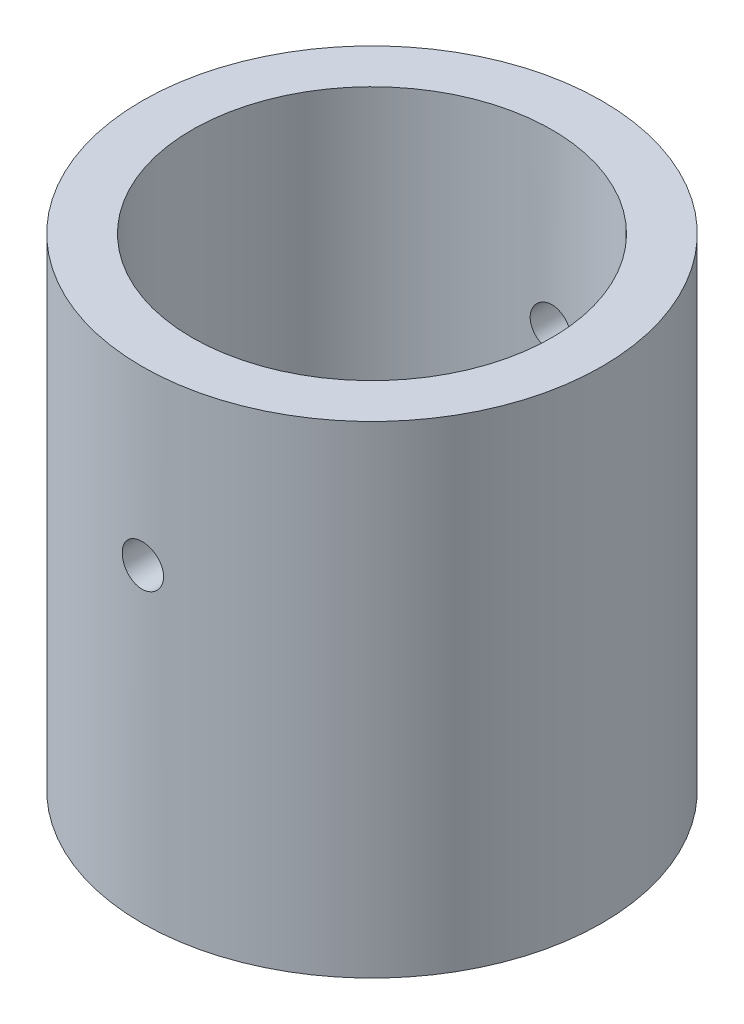
ISO-10303-21;
HEADER;
FILE_DESCRIPTION(('STEP AP214'),'2;1');
FILE_NAME('part.step','',(''),(''),'','','');
FILE_SCHEMA(('AUTOMOTIVE_DESIGN { 1 0 10303 214 1 1 1 1 }'));
ENDSEC;
DATA;
#1=APPLICATION_CONTEXT('core data for automotive mechanical design processes');
#2=APPLICATION_PROTOCOL_DEFINITION('international standard','automotive_design',2000,#1);
#3=PRODUCT_CONTEXT('',#1,'mechanical');
#4=PRODUCT('Part','Part','',(#3));
#5=PRODUCT_RELATED_PRODUCT_CATEGORY('part','',(#4));
#6=PRODUCT_DEFINITION_FORMATION('','',#4);
#7=PRODUCT_DEFINITION_CONTEXT('part definition',#1,'design');
#8=PRODUCT_DEFINITION('design','',#6,#7);
#9=PRODUCT_DEFINITION_SHAPE('','',#8);
#10=(LENGTH_UNIT() NAMED_UNIT(*) SI_UNIT(.MILLI.,.METRE.));
#11=(NAMED_UNIT(*) PLANE_ANGLE_UNIT() SI_UNIT($,.RADIAN.));
#12=(NAMED_UNIT(*) SI_UNIT($,.STERADIAN.) SOLID_ANGLE_UNIT());
#13=UNCERTAINTY_MEASURE_WITH_UNIT(LENGTH_MEASURE(1.E-05),#10,'distance_accuracy_value','');
#14=(GEOMETRIC_REPRESENTATION_CONTEXT(3) GLOBAL_UNCERTAINTY_ASSIGNED_CONTEXT((#13)) GLOBAL_UNIT_ASSIGNED_CONTEXT((#10,
#11,#12)) REPRESENTATION_CONTEXT('',''));
#15=CARTESIAN_POINT('',(0.,0.,0.));
#16=DIRECTION('',(0.,0.,1.));
#17=DIRECTION('',(1.,0.,0.));
#18=AXIS2_PLACEMENT_3D('',#15,#16,#17);
#19=CARTESIAN_POINT('',(0.,-10.,0.));
#20=DIRECTION('',(0.,1.,0.));
#21=DIRECTION('',(0.,0.,1.));
#22=AXIS2_PLACEMENT_3D('',#19,#20,#21);
#23=CYLINDRICAL_SURFACE('',#22,16.7005);
#24=CARTESIAN_POINT('',(0.,14.,-16.7005));
#25=CARTESIAN_POINT('',(0.0840739073478822,13.9999963389162,-16.7004991224491));
#26=CARTESIAN_POINT('',(0.168204443302505,13.9929077938446,-16.6998583708692));
#27=CARTESIAN_POINT('',(0.334136064030357,13.9647355315386,-16.6973638947488));
#28=CARTESIAN_POINT('',(0.415934428993811,13.9436361192293,-16.6955088099366));
#29=CARTESIAN_POINT('',(0.574774611508852,13.8880587094413,-16.6907952172819));
#30=CARTESIAN_POINT('',(0.651819157286573,13.853588469858,-16.6879372913899));
#31=CARTESIAN_POINT('',(0.799011016182334,13.7722622127763,-16.6815381735413));
#32=CARTESIAN_POINT('',(0.869159762218119,13.7254087759492,-16.6779971239898));
#33=CARTESIAN_POINT('',(1.00079248873406,13.6204980050071,-16.6706172347535));
#34=CARTESIAN_POINT('',(1.06225341632177,13.5624117964417,-16.6667776431958));
#35=CARTESIAN_POINT('',(1.17456792134735,13.4367456019084,-16.6592396902912));
#36=CARTESIAN_POINT('',(1.22542102394026,13.369165191172,-16.6555413352727));
#37=CARTESIAN_POINT('',(1.31515586886251,13.2262874315252,-16.6486966845945));
#38=CARTESIAN_POINT('',(1.35401710508066,13.1509771542979,-16.6455513384882));
#39=CARTESIAN_POINT('',(1.41853412471455,12.9948673718815,-16.6401777460108));
#40=CARTESIAN_POINT('',(1.4441901754162,12.9140679778349,-16.6379494810774));
#41=CARTESIAN_POINT('',(1.48150106735208,12.7495062868371,-16.6346688669631));
#42=CARTESIAN_POINT('',(1.49319375199995,12.665752634481,-16.6336133399801));
#43=CARTESIAN_POINT('',(1.50236293564543,12.4974654132801,-16.6327877449639));
#44=CARTESIAN_POINT('',(1.49983974065433,12.4129318612625,-16.6330176492604));
#45=CARTESIAN_POINT('',(1.48068003297399,12.245744336756,-16.6347340465401));
#46=CARTESIAN_POINT('',(1.46408471843637,12.1630856000218,-16.6362168713737));
#47=CARTESIAN_POINT('',(1.41731589335676,12.0017314772819,-16.6402662890315));
#48=CARTESIAN_POINT('',(1.38714223144538,11.9230361354704,-16.6428328939377));
#49=CARTESIAN_POINT('',(1.3140273437971,11.7717118042245,-16.6487649035404));
#50=CARTESIAN_POINT('',(1.27106770992614,11.6990917559108,-16.652131458517));
#51=CARTESIAN_POINT('',(1.17361359847447,11.5620772286155,-16.6592830161986));
#52=CARTESIAN_POINT('',(1.11911884900944,11.4976829435737,-16.6630680287658));
#53=CARTESIAN_POINT('',(0.999910698845735,11.3787083676798,-16.6706463571184));
#54=CARTESIAN_POINT('',(0.93516169524744,11.3241637420956,-16.6744396546541));
#55=CARTESIAN_POINT('',(0.797407017723522,11.2267128116824,-16.6815943820547));
#56=CARTESIAN_POINT('',(0.72440133703474,11.1838065163867,-16.6849558115658));
#57=CARTESIAN_POINT('',(0.572181924093607,11.110852128623,-16.6908688650665));
#58=CARTESIAN_POINT('',(0.492967389955397,11.0808057002807,-16.6934203842388));
#59=CARTESIAN_POINT('',(0.33058989114569,11.0344493534954,-16.6974249840035));
#60=CARTESIAN_POINT('',(0.247427021734967,11.0181391038196,-16.6988780910827));
#61=CARTESIAN_POINT('',(0.0798225786995192,10.9997630131269,-16.7005187417049));
#62=CARTESIAN_POINT('',(-0.00461355466242807,10.9976479266711,-16.7007106604767));
#63=CARTESIAN_POINT('',(-0.17263916704392,11.007593072566,-16.699819013058));
#64=CARTESIAN_POINT('',(-0.256228655248612,11.0196531509657,-16.6987354607201));
#65=CARTESIAN_POINT('',(-0.42004713057965,11.0575654545316,-16.6954175015306));
#66=CARTESIAN_POINT('',(-0.500281462032379,11.0833947683984,-16.6931850066731));
#67=CARTESIAN_POINT('',(-0.655277824431181,11.1480888896812,-16.6878198274718));
#68=CARTESIAN_POINT('',(-0.730039755381432,11.1869539352235,-16.6846871266837));
#69=CARTESIAN_POINT('',(-0.872192674320689,11.2767394402738,-16.6778615217508));
#70=CARTESIAN_POINT('',(-0.939563045677524,11.3276924251232,-16.6741671160137));
#71=CARTESIAN_POINT('',(-1.06481212264239,11.4401605849513,-16.6666379310917));
#72=CARTESIAN_POINT('',(-1.12269063651724,11.5016759732366,-16.6628031490732));
#73=CARTESIAN_POINT('',(-1.22748272152723,11.6337368754473,-16.6554123832421));
#74=CARTESIAN_POINT('',(-1.27436408880999,11.7043079970349,-16.6518572380307));
#75=CARTESIAN_POINT('',(-1.35561007066878,11.8523500751879,-16.6454405041055));
#76=CARTESIAN_POINT('',(-1.38997482741231,11.9298209533713,-16.6425789075142));
#77=CARTESIAN_POINT('',(-1.44515758812037,12.0893507223554,-16.6378781983044));
#78=CARTESIAN_POINT('',(-1.46599510231504,12.1714028192381,-16.6360376136491));
#79=CARTESIAN_POINT('',(-1.49359532085713,12.3378584243099,-16.633582545586));
#80=CARTESIAN_POINT('',(-1.5003583442629,12.4222618791515,-16.6329680343839));
#81=CARTESIAN_POINT('',(-1.49961365022275,12.590704248327,-16.6330351676116));
#82=CARTESIAN_POINT('',(-1.49215652690292,12.6747433927842,-16.6337122167778));
#83=CARTESIAN_POINT('',(-1.46328893309136,12.8403703160216,-16.6362764087617));
#84=CARTESIAN_POINT('',(-1.44187844319134,12.9219580913918,-16.6381635532625));
#85=CARTESIAN_POINT('',(-1.38572513293063,13.0803682109211,-16.642934070122));
#86=CARTESIAN_POINT('',(-1.35098344213868,13.1571909581863,-16.645817358074));
#87=CARTESIAN_POINT('',(-1.26915938382259,13.303922169385,-16.6522554477643));
#88=CARTESIAN_POINT('',(-1.22207716396824,13.3738307160418,-16.6558102414669));
#89=CARTESIAN_POINT('',(-1.11671831492446,13.5050082316671,-16.6632059007733));
#90=CARTESIAN_POINT('',(-1.05840410454961,13.5662469638901,-16.6670476994806));
#91=CARTESIAN_POINT('',(-0.932307639342731,13.6780940869861,-16.6745759524764));
#92=CARTESIAN_POINT('',(-0.864523105698723,13.7286999119381,-16.6782623690971));
#93=CARTESIAN_POINT('',(-0.72125920724578,13.8179242258068,-16.6850722283804));
#94=CARTESIAN_POINT('',(-0.645763987079093,13.8565173261441,-16.6881944729198));
#95=CARTESIAN_POINT('',(-0.489387213644493,13.9204291584459,-16.6935105885476));
#96=CARTESIAN_POINT('',(-0.408511928020682,13.9457630420884,-16.6957055187484));
#97=CARTESIAN_POINT('',(-0.272638732752223,13.9760347333788,-16.6983606057811));
#98=CARTESIAN_POINT('',(-0.21851279009077,13.9850096412518,-16.6991591938122));
#99=CARTESIAN_POINT('',(-0.109599253243924,13.9969934585151,-16.7002291761435));
#100=CARTESIAN_POINT('',(-0.0548116611578381,14.0000023868295,-16.7005005721159));
#101=CARTESIAN_POINT('',(0.,14.,-16.7005));
#102=B_SPLINE_CURVE_WITH_KNOTS('',3,(#24,#25,#26,#27,#28,#29,#30,#31,#32,#33,#34,#35,#36,#37,
#38,#39,#40,#41,#42,#43,#44,#45,#46,#47,#48,#49,#50,#51,#52,#53,#54,#55,#56,#57,#58,#59,#60,#61,
#62,#63,#64,#65,#66,#67,#68,#69,#70,#71,#72,#73,#74,#75,#76,#77,#78,#79,#80,#81,#82,#83,#84,#85,
#86,#87,#88,#89,#90,#91,#92,#93,#94,#95,#96,#97,#98,#99,#100,#101),.UNSPECIFIED.,.T.,.F.,(4,2,2,
2,2,2,2,2,2,2,2,2,2,2,2,2,2,2,2,2,2,2,2,2,2,2,2,2,2,2,2,2,2,2,2,2,2,2,4),(0.,0.25202158895579,
0.504325971650677,0.756484183115543,1.00858988592701,1.26135246778805,1.51412636179746,
1.76733013447015,2.02052878184841,2.2730396433461,2.5255450693112,2.77731379156742,
3.02908532057347,3.28122109640866,3.53336281578168,3.78639998339604,4.03943735827815,
4.29250746746459,4.54557147397378,4.79775710248519,5.04993999212971,5.30170456623724,
5.55347373962887,5.80592819611591,6.05838775149278,6.31157762459116,6.56476462179142,
6.81758563336241,7.07040091360438,7.32231837560675,7.57423618801164,7.82613265982793,
8.07802611752714,8.33077750628205,8.58358981883721,8.83693287151226,9.08998578639345,
9.25429081504527,9.41859532252041),.UNSPECIFIED.);
#103=CARTESIAN_POINT('',(0.,14.,-16.7005));
#104=VERTEX_POINT('',#103);
#105=EDGE_CURVE('E82',#104,#104,#102,.T.);
#106=ORIENTED_EDGE('',*,*,#105,.F.);
#107=EDGE_LOOP('',(#106));
#108=FACE_BOUND('',#107,.T.);
#109=CARTESIAN_POINT('',(0.,11.,16.7005));
#110=CARTESIAN_POINT('',(0.0840739073478822,11.0000036610838,16.7004991224491));
#111=CARTESIAN_POINT('',(0.168204443302505,11.0070922061554,16.6998583708692));
#112=CARTESIAN_POINT('',(0.334136064030357,11.0352644684614,16.6973638947488));
#113=CARTESIAN_POINT('',(0.415934428993811,11.0563638807707,16.6955088099366));
#114=CARTESIAN_POINT('',(0.574774611508852,11.1119412905587,16.6907952172819));
#115=CARTESIAN_POINT('',(0.651819157286573,11.146411530142,16.6879372913899));
#116=CARTESIAN_POINT('',(0.799011016182334,11.2277377872237,16.6815381735413));
#117=CARTESIAN_POINT('',(0.869159762218119,11.2745912240508,16.6779971239898));
#118=CARTESIAN_POINT('',(1.00079248873406,11.3795019949929,16.6706172347535));
#119=CARTESIAN_POINT('',(1.06225341632177,11.4375882035583,16.6667776431958));
#120=CARTESIAN_POINT('',(1.17456792134735,11.5632543980916,16.6592396902912));
#121=CARTESIAN_POINT('',(1.22542102394026,11.630834808828,16.6555413352727));
#122=CARTESIAN_POINT('',(1.31515586886251,11.7737125684748,16.6486966845945));
#123=CARTESIAN_POINT('',(1.35401710508066,11.8490228457021,16.6455513384882));
#124=CARTESIAN_POINT('',(1.41853412471455,12.0051326281185,16.6401777460108));
#125=CARTESIAN_POINT('',(1.4441901754162,12.0859320221651,16.6379494810774));
#126=CARTESIAN_POINT('',(1.48150106735208,12.2504937131629,16.6346688669631));
#127=CARTESIAN_POINT('',(1.49319375199995,12.334247365519,16.6336133399801));
#128=CARTESIAN_POINT('',(1.50236293564543,12.5025345867199,16.6327877449639));
#129=CARTESIAN_POINT('',(1.49983974065433,12.5870681387374,16.6330176492604));
#130=CARTESIAN_POINT('',(1.48068003297399,12.754255663244,16.6347340465401));
#131=CARTESIAN_POINT('',(1.46408471843637,12.8369143999782,16.6362168713737));
#132=CARTESIAN_POINT('',(1.41731589335676,12.998268522718,16.6402662890315));
#133=CARTESIAN_POINT('',(1.38714223144538,13.0769638645296,16.6428328939377));
#134=CARTESIAN_POINT('',(1.3140273437971,13.2282881957755,16.6487649035404));
#135=CARTESIAN_POINT('',(1.27106770992614,13.3009082440892,16.652131458517));
#136=CARTESIAN_POINT('',(1.17361359847447,13.4379227713845,16.6592830161986));
#137=CARTESIAN_POINT('',(1.11911884900944,13.5023170564263,16.6630680287658));
#138=CARTESIAN_POINT('',(0.999910698845735,13.6212916323202,16.6706463571184));
#139=CARTESIAN_POINT('',(0.93516169524744,13.6758362579044,16.6744396546541));
#140=CARTESIAN_POINT('',(0.797407017723522,13.7732871883176,16.6815943820547));
#141=CARTESIAN_POINT('',(0.72440133703474,13.8161934836133,16.6849558115658));
#142=CARTESIAN_POINT('',(0.572181924093607,13.889147871377,16.6908688650665));
#143=CARTESIAN_POINT('',(0.492967389955397,13.9191942997193,16.6934203842388));
#144=CARTESIAN_POINT('',(0.33058989114569,13.9655506465046,16.6974249840035));
#145=CARTESIAN_POINT('',(0.247427021734967,13.9818608961803,16.6988780910827));
#146=CARTESIAN_POINT('',(0.0798225786995192,14.0002369868731,16.7005187417049));
#147=CARTESIAN_POINT('',(-0.00461355466242807,14.0023520733289,16.7007106604767));
#148=CARTESIAN_POINT('',(-0.17263916704392,13.992406927434,16.699819013058));
#149=CARTESIAN_POINT('',(-0.256228655248612,13.9803468490343,16.6987354607201));
#150=CARTESIAN_POINT('',(-0.42004713057965,13.9424345454684,16.6954175015306));
#151=CARTESIAN_POINT('',(-0.500281462032378,13.9166052316016,16.6931850066731));
#152=CARTESIAN_POINT('',(-0.655277824431181,13.8519111103188,16.6878198274718));
#153=CARTESIAN_POINT('',(-0.730039755381432,13.8130460647765,16.6846871266837));
#154=CARTESIAN_POINT('',(-0.872192674320689,13.7232605597262,16.6778615217508));
#155=CARTESIAN_POINT('',(-0.939563045677524,13.6723075748768,16.6741671160137));
#156=CARTESIAN_POINT('',(-1.06481212264239,13.5598394150487,16.6666379310917));
#157=CARTESIAN_POINT('',(-1.12269063651724,13.4983240267634,16.6628031490732));
#158=CARTESIAN_POINT('',(-1.22748272152723,13.3662631245527,16.6554123832421));
#159=CARTESIAN_POINT('',(-1.27436408880999,13.2956920029651,16.6518572380307));
#160=CARTESIAN_POINT('',(-1.35561007066878,13.1476499248121,16.6454405041055));
#161=CARTESIAN_POINT('',(-1.38997482741231,13.0701790466287,16.6425789075142));
#162=CARTESIAN_POINT('',(-1.44515758812037,12.9106492776446,16.6378781983044));
#163=CARTESIAN_POINT('',(-1.46599510231504,12.8285971807619,16.6360376136491));
#164=CARTESIAN_POINT('',(-1.49359532085713,12.6621415756901,16.633582545586));
#165=CARTESIAN_POINT('',(-1.5003583442629,12.5777381208485,16.6329680343839));
#166=CARTESIAN_POINT('',(-1.49961365022275,12.409295751673,16.6330351676116));
#167=CARTESIAN_POINT('',(-1.49215652690292,12.3252566072158,16.6337122167778));
#168=CARTESIAN_POINT('',(-1.46328893309136,12.1596296839784,16.6362764087617));
#169=CARTESIAN_POINT('',(-1.44187844319134,12.0780419086082,16.6381635532625));
#170=CARTESIAN_POINT('',(-1.38572513293063,11.9196317890789,16.642934070122));
#171=CARTESIAN_POINT('',(-1.35098344213868,11.8428090418137,16.645817358074));
#172=CARTESIAN_POINT('',(-1.26915938382259,11.696077830615,16.6522554477643));
#173=CARTESIAN_POINT('',(-1.22207716396824,11.6261692839582,16.6558102414669));
#174=CARTESIAN_POINT('',(-1.11671831492446,11.4949917683329,16.6632059007733));
#175=CARTESIAN_POINT('',(-1.05840410454961,11.4337530361099,16.6670476994806));
#176=CARTESIAN_POINT('',(-0.932307639342731,11.3219059130139,16.6745759524764));
#177=CARTESIAN_POINT('',(-0.864523105698723,11.2713000880619,16.6782623690971));
#178=CARTESIAN_POINT('',(-0.72125920724578,11.1820757741932,16.6850722283804));
#179=CARTESIAN_POINT('',(-0.645763987079093,11.1434826738559,16.6881944729198));
#180=CARTESIAN_POINT('',(-0.489387213644493,11.0795708415541,16.6935105885476));
#181=CARTESIAN_POINT('',(-0.408511928020682,11.0542369579116,16.6957055187484));
#182=CARTESIAN_POINT('',(-0.272638732752223,11.0239652666212,16.6983606057811));
#183=CARTESIAN_POINT('',(-0.218512790090771,11.0149903587482,16.6991591938122));
#184=CARTESIAN_POINT('',(-0.109599253243924,11.0030065414849,16.7002291761435));
#185=CARTESIAN_POINT('',(-0.0548116611578381,10.9999976131705,16.7005005721159));
#186=CARTESIAN_POINT('',(0.,11.,16.7005));
#187=B_SPLINE_CURVE_WITH_KNOTS('',3,(#109,#110,#111,#112,#113,#114,#115,#116,#117,#118,#119,
#120,#121,#122,#123,#124,#125,#126,#127,#128,#129,#130,#131,#132,#133,#134,#135,#136,#137,#138,
#139,#140,#141,#142,#143,#144,#145,#146,#147,#148,#149,#150,#151,#152,#153,#154,#155,#156,#157,
#158,#159,#160,#161,#162,#163,#164,#165,#166,#167,#168,#169,#170,#171,#172,#173,#174,#175,#176,
#177,#178,#179,#180,#181,#182,#183,#184,#185,#186),.UNSPECIFIED.,.T.,.F.,(4,2,2,2,2,2,2,2,2,2,2,
2,2,2,2,2,2,2,2,2,2,2,2,2,2,2,2,2,2,2,2,2,2,2,2,2,2,2,4),(0.,0.25202158895579,0.504325971650677,
0.756484183115543,1.00858988592701,1.26135246778805,1.51412636179746,1.76733013447015,
2.02052878184841,2.2730396433461,2.5255450693112,2.77731379156742,3.02908532057347,
3.28122109640866,3.53336281578168,3.78639998339604,4.03943735827815,4.29250746746459,
4.54557147397378,4.79775710248519,5.04993999212971,5.30170456623724,5.55347373962887,
5.8059281961159,6.05838775149278,6.31157762459116,6.56476462179142,6.81758563336241,
7.07040091360438,7.32231837560675,7.57423618801164,7.82613265982793,8.07802611752714,
8.33077750628205,8.58358981883721,8.83693287151226,9.08998578639345,9.25429081504527,
9.41859532252041),.UNSPECIFIED.);
#188=CARTESIAN_POINT('',(0.,11.,16.7005));
#189=VERTEX_POINT('',#188);
#190=EDGE_CURVE('E88',#189,#189,#187,.T.);
#191=ORIENTED_EDGE('',*,*,#190,.F.);
#192=EDGE_LOOP('',(#191));
#193=FACE_BOUND('',#192,.T.);
#194=CARTESIAN_POINT('',(0.,-10.,0.));
#195=DIRECTION('',(0.,1.,0.));
#196=DIRECTION('',(0.,0.,1.));
#197=AXIS2_PLACEMENT_3D('',#194,#195,#196);
#198=CIRCLE('',#197,16.7005);
#199=CARTESIAN_POINT('',(0.,-10.,16.7005));
#200=VERTEX_POINT('',#199);
#201=EDGE_CURVE('E10',#200,#200,#198,.T.);
#202=ORIENTED_EDGE('',*,*,#201,.T.);
#203=EDGE_LOOP('',(#202));
#204=FACE_BOUND('',#203,.T.);
#205=CARTESIAN_POINT('',(0.,25.,0.));
#206=DIRECTION('',(0.,1.,0.));
#207=DIRECTION('',(0.,0.,1.));
#208=AXIS2_PLACEMENT_3D('',#205,#206,#207);
#209=CIRCLE('',#208,16.7005);
#210=CARTESIAN_POINT('',(0.,25.,16.7005));
#211=VERTEX_POINT('',#210);
#212=EDGE_CURVE('E59',#211,#211,#209,.T.);
#213=ORIENTED_EDGE('',*,*,#212,.F.);
#214=EDGE_LOOP('',(#213));
#215=FACE_BOUND('',#214,.T.);
#216=ADVANCED_FACE('F39',(#108,#193,#204,#215),#23,.T.);
#217=CARTESIAN_POINT('',(0.,-10.,0.));
#218=DIRECTION('',(0.,1.,0.));
#219=DIRECTION('',(0.,0.,1.));
#220=AXIS2_PLACEMENT_3D('',#217,#218,#219);
#221=PLANE('',#220);
#222=CARTESIAN_POINT('',(0.,-10.,0.));
#223=DIRECTION('',(0.,1.,0.));
#224=DIRECTION('',(0.,0.,1.));
#225=AXIS2_PLACEMENT_3D('',#222,#223,#224);
#226=CIRCLE('',#225,13.0683);
#227=CARTESIAN_POINT('',(0.,-10.,13.0683));
#228=VERTEX_POINT('',#227);
#229=EDGE_CURVE('E53',#228,#228,#226,.T.);
#230=ORIENTED_EDGE('',*,*,#229,.T.);
#231=EDGE_LOOP('',(#230));
#232=FACE_BOUND('',#231,.T.);
#233=ORIENTED_EDGE('',*,*,#201,.F.);
#234=EDGE_LOOP('',(#233));
#235=FACE_BOUND('',#234,.T.);
#236=ADVANCED_FACE('F105',(#232,#235),#221,.F.);
#237=CARTESIAN_POINT('',(0.,-10.,0.));
#238=DIRECTION('',(0.,1.,0.));
#239=DIRECTION('',(0.,0.,1.));
#240=AXIS2_PLACEMENT_3D('',#237,#238,#239);
#241=CYLINDRICAL_SURFACE('',#240,13.0683);
#242=CARTESIAN_POINT('',(0.,11.,13.0683));
#243=CARTESIAN_POINT('',(0.083959419714348,11.0000035986928,13.0682989093014));
#244=CARTESIAN_POINT('',(0.167972632303433,11.007072937343,13.0674823154631));
#245=CARTESIAN_POINT('',(0.333665011174969,11.0351644457216,13.0643032966192));
#246=CARTESIAN_POINT('',(0.415341584298046,11.0562015343523,13.0619392187899));
#247=CARTESIAN_POINT('',(0.573937670412875,11.1116038108933,13.0559317916325));
#248=CARTESIAN_POINT('',(0.650860206039492,11.145960426987,13.0522892651959));
#249=CARTESIAN_POINT('',(0.797831776722439,11.2270086369988,13.0441310084045));
#250=CARTESIAN_POINT('',(0.867882068984447,11.2736979689822,13.0396154382147));
#251=CARTESIAN_POINT('',(0.9994638663028,11.3783200726841,13.0301923642005));
#252=CARTESIAN_POINT('',(1.06095863543785,11.4362989110897,13.0252833047485));
#253=CARTESIAN_POINT('',(1.17336764914877,11.5617555217076,13.0156392138925));
#254=CARTESIAN_POINT('',(1.22428137688855,11.6292337576527,13.0109041909988));
#255=CARTESIAN_POINT('',(1.31421722863886,11.7720089488374,13.0021287819106));
#256=CARTESIAN_POINT('',(1.35320540530628,11.8473274212194,12.9980903927282));
#257=CARTESIAN_POINT('',(1.4179666531661,12.0034966034056,12.9911855685421));
#258=CARTESIAN_POINT('',(1.44374014890661,12.0843471353867,12.9883190958887));
#259=CARTESIAN_POINT('',(1.48122986195858,12.2489066044632,12.9840972331607));
#260=CARTESIAN_POINT('',(1.49300769207949,12.3326013322305,12.9827352219109));
#261=CARTESIAN_POINT('',(1.50236231243369,12.5007897361557,12.9816561268342));
#262=CARTESIAN_POINT('',(1.49993958736373,12.5852833849464,12.9819389868643));
#263=CARTESIAN_POINT('',(1.48101253301551,12.7522438209895,12.9841116185447));
#264=CARTESIAN_POINT('',(1.46457581120456,12.8347183869907,12.9859936750729));
#265=CARTESIAN_POINT('',(1.41819270046793,12.9957307132692,12.9911406025717));
#266=CARTESIAN_POINT('',(1.38824607727181,13.0742684052524,12.9944054975215));
#267=CARTESIAN_POINT('',(1.31561972100485,13.2253891590206,13.0019590421739));
#268=CARTESIAN_POINT('',(1.272910341207,13.2979578492859,13.0062500708046));
#269=CARTESIAN_POINT('',(1.1759920818651,13.4349232552091,13.0153704876364));
#270=CARTESIAN_POINT('',(1.1217827586042,13.4993196553918,13.0201998966072));
#271=CARTESIAN_POINT('',(1.00302746089424,13.6185051167426,13.0298872647189));
#272=CARTESIAN_POINT('',(0.938423162479797,13.6732360810241,13.0347452264357));
#273=CARTESIAN_POINT('',(0.800913349316004,13.7710856037659,13.0439159367024));
#274=CARTESIAN_POINT('',(0.728007820175392,13.814204142094,13.0482286843071));
#275=CARTESIAN_POINT('',(0.57592224284429,13.8876038435033,13.0558251378022));
#276=CARTESIAN_POINT('',(0.496740569888844,13.9178816694194,13.0591085761283));
#277=CARTESIAN_POINT('',(0.33437108477933,13.9646958954565,13.064273918848));
#278=CARTESIAN_POINT('',(0.251183430760447,13.9812328375259,13.0661558785163));
#279=CARTESIAN_POINT('',(0.0836660485400474,14.0000212696477,13.0682990732304));
#280=CARTESIAN_POINT('',(-0.000654585261720961,14.0023528506097,13.0685693946301));
#281=CARTESIAN_POINT('',(-0.168485383880464,13.9928752994393,13.0674833148144));
#282=CARTESIAN_POINT('',(-0.251995563170554,13.9810664202976,13.0661269427027));
#283=CARTESIAN_POINT('',(-0.415600827269171,13.9437096583779,13.0619455971228));
#284=CARTESIAN_POINT('',(-0.49570467588172,13.9181996650982,13.0591246744835));
#285=CARTESIAN_POINT('',(-0.650496831963124,13.8542040038225,13.0523303149499));
#286=CARTESIAN_POINT('',(-0.725184982139591,13.8157179591361,13.0483568445981));
#287=CARTESIAN_POINT('',(-0.867385244335154,13.7266667891655,13.0396783400163));
#288=CARTESIAN_POINT('',(-0.934864496182109,13.6760495014219,13.0349701780965));
#289=CARTESIAN_POINT('',(-1.06039788918208,13.5642469105692,13.0253595891529));
#290=CARTESIAN_POINT('',(-1.11845171654463,13.5030612557586,13.0204571556683));
#291=CARTESIAN_POINT('',(-1.22376785434973,13.3715073982892,13.0109828195366));
#292=CARTESIAN_POINT('',(-1.27097730012458,13.3010967353124,13.0064126073356));
#293=CARTESIAN_POINT('',(-1.35290014736306,13.1532990638355,12.9981471218405));
#294=CARTESIAN_POINT('',(-1.38761376551905,13.0759121763404,12.9944518333746));
#295=CARTESIAN_POINT('',(-1.44347270379213,12.9165340140986,12.9883657378988));
#296=CARTESIAN_POINT('',(-1.46464854488605,12.8345535530614,12.9859719983773));
#297=CARTESIAN_POINT('',(-1.49292945170328,12.6681714156221,12.98275134275));
#298=CARTESIAN_POINT('',(-1.50003506175628,12.5837698330131,12.9819243660316));
#299=CARTESIAN_POINT('',(-1.49996488082419,12.4154669874023,12.9819324335816));
#300=CARTESIAN_POINT('',(-1.49287213345557,12.3315656770913,12.9827578135174));
#301=CARTESIAN_POINT('',(-1.46478167472506,12.1661555646921,12.9859568932676));
#302=CARTESIAN_POINT('',(-1.44378395510147,12.0846467640255,12.988330594002));
#303=CARTESIAN_POINT('',(-1.38850427243594,11.9263419132945,12.9943560060979));
#304=CARTESIAN_POINT('',(-1.35422564254193,11.8495446863503,12.9980073967717));
#305=CARTESIAN_POINT('',(-1.27336545078431,11.7027795743084,13.0061773552408));
#306=CARTESIAN_POINT('',(-1.22678383101695,11.632811721355,13.0106959271174));
#307=CARTESIAN_POINT('',(-1.1223299454544,11.5012663380542,13.0201228080858));
#308=CARTESIAN_POINT('',(-1.06439573688705,11.4397381376282,13.0250331635438));
#309=CARTESIAN_POINT('',(-0.93900846000665,11.3272433618148,13.0346719610345));
#310=CARTESIAN_POINT('',(-0.87155313611058,11.2762792961879,13.0394003596223));
#311=CARTESIAN_POINT('',(-0.728792444723197,11.1862230955074,13.0481590051423));
#312=CARTESIAN_POINT('',(-0.653462415729782,11.147169854317,13.0521869467687));
#313=CARTESIAN_POINT('',(-0.497312067577631,11.0823215075292,13.0590669048896));
#314=CARTESIAN_POINT('',(-0.41649792465187,11.0565117586709,13.0619202194697));
#315=CARTESIAN_POINT('',(-0.279373312983838,11.0251738791891,13.0654288600473));
#316=CARTESIAN_POINT('',(-0.223933015819383,11.0157469474946,13.0665003907032));
#317=CARTESIAN_POINT('',(-0.112336504769582,11.0031588222733,13.0679363235181));
#318=CARTESIAN_POINT('',(-0.0561802950866237,10.999997591984,13.068300729826));
#319=CARTESIAN_POINT('',(0.,11.,13.0683));
#320=B_SPLINE_CURVE_WITH_KNOTS('',3,(#242,#243,#244,#245,#246,#247,#248,#249,#250,#251,#252,
#253,#254,#255,#256,#257,#258,#259,#260,#261,#262,#263,#264,#265,#266,#267,#268,#269,#270,#271,
#272,#273,#274,#275,#276,#277,#278,#279,#280,#281,#282,#283,#284,#285,#286,#287,#288,#289,#290,
#291,#292,#293,#294,#295,#296,#297,#298,#299,#300,#301,#302,#303,#304,#305,#306,#307,#308,#309,
#310,#311,#312,#313,#314,#315,#316,#317,#318,#319),.UNSPECIFIED.,.T.,.F.,(4,2,2,2,2,2,2,2,2,2,2,
2,2,2,2,2,2,2,2,2,2,2,2,2,2,2,2,2,2,2,2,2,2,2,2,2,2,2,4),(0.,0.251673076696307,
0.503615397841711,0.755395849277337,1.00713015386066,1.25991403787444,1.51271026633902,
1.76621954901159,2.01972068667977,2.27210165800259,2.52447401504791,2.77563570142195,
3.02680174326999,3.27855581733137,3.53031960690563,3.78354868392285,4.03677819995216,
4.29007348737733,4.54335878421227,4.79521470772957,5.0470661252907,5.29822462425576,
5.54939041489522,5.80165619229906,6.05393036639353,6.30740940560953,6.56088404898891,
6.81378519846032,7.06667656384983,7.31809313513363,7.56950985579768,7.82086351852121,
8.07221836425603,8.32498490431382,8.57781142640281,8.8314549060649,9.08481732581798,
9.25322190413147,9.42162549436901),.UNSPECIFIED.);
#321=CARTESIAN_POINT('',(0.,11.,13.0683));
#322=VERTEX_POINT('',#321);
#323=EDGE_CURVE('E43',#322,#322,#320,.T.);
#324=ORIENTED_EDGE('',*,*,#323,.T.);
#325=EDGE_LOOP('',(#324));
#326=FACE_BOUND('',#325,.T.);
#327=CARTESIAN_POINT('',(1.5,12.5,-12.9819283964286));
#328=CARTESIAN_POINT('',(1.49999639948689,12.4160426343039,-12.9819295142281));
#329=CARTESIAN_POINT('',(1.49292739504628,12.3320314695184,-12.9827516433486));
#330=CARTESIAN_POINT('',(1.46483733478457,12.1663433452089,-12.9859504308004));
#331=CARTESIAN_POINT('',(1.44380135288027,12.0846689804578,-12.9883287521473));
#332=CARTESIAN_POINT('',(1.38840231362,11.926077564794,-12.9943670655967));
#333=CARTESIAN_POINT('',(1.35404788062388,11.8491574725493,-12.9980262281421));
#334=CARTESIAN_POINT('',(1.2730048122647,11.7021899988986,-13.0062129207465));
#335=CARTESIAN_POINT('',(1.22631843350853,11.6321413633063,-13.0107402918915));
#336=CARTESIAN_POINT('',(1.1216993181703,11.5005577075767,-13.0201773288729));
#337=CARTESIAN_POINT('',(1.06371985463791,11.4390599451918,-13.0250885304977));
#338=CARTESIAN_POINT('',(0.938260735323255,11.3266451509393,-13.034725998433));
#339=CARTESIAN_POINT('',(0.870780623994517,11.2757286267215,-13.0394522558617));
#340=CARTESIAN_POINT('',(0.728003777451471,11.1857898409728,-13.0482028321936));
#341=CARTESIAN_POINT('',(0.652685847671348,11.1468010158646,-13.0522251645646));
#342=CARTESIAN_POINT('',(0.496517844443559,11.0820384196668,-13.0590978665634));
#343=CARTESIAN_POINT('',(0.415667945635392,11.0562642316204,-13.0619482731682));
#344=CARTESIAN_POINT('',(0.251110464666611,11.0187730862816,-13.0661451565985));
#345=CARTESIAN_POINT('',(0.167417105589314,11.0069944507645,-13.0674982303249));
#346=CARTESIAN_POINT('',(-0.000768614799016916,10.9976377453511,-13.0685704840143));
#347=CARTESIAN_POINT('',(-0.0852609492401519,11.0000591995833,-13.0682897187303));
#348=CARTESIAN_POINT('',(-0.252226963949748,11.0189842322593,-13.0661312925977));
#349=CARTESIAN_POINT('',(-0.334708273126346,11.0354214828452,-13.0642611533834));
#350=CARTESIAN_POINT('',(-0.495733812382923,11.0818079847283,-13.0591426352426));
#351=CARTESIAN_POINT('',(-0.574277977686489,11.1117574582562,-13.0558942336484));
#352=CARTESIAN_POINT('',(-0.725406615887272,11.1843897360309,-13.0483713100679));
#353=CARTESIAN_POINT('',(-0.797977037878727,11.2271015252386,-13.0440944566904));
#354=CARTESIAN_POINT('',(-0.934944887345913,11.3240249375773,-13.0349937398804));
#355=CARTESIAN_POINT('',(-0.999341998531956,11.3782370055277,-13.0301698552927));
#356=CARTESIAN_POINT('',(-1.11852439568365,11.4969942620616,-13.0204827604716));
#357=CARTESIAN_POINT('',(-1.17325213787293,11.5615972112265,-13.0156194838352));
#358=CARTESIAN_POINT('',(-1.27109580075301,11.6991031725672,-13.0064292964046));
#359=CARTESIAN_POINT('',(-1.31421169455925,11.7720062039593,-13.0021023868523));
#360=CARTESIAN_POINT('',(-1.38760948881469,11.9240910797439,-12.994474731255));
#361=CARTESIAN_POINT('',(-1.41788723983766,12.0032749443682,-12.9911743170761));
#362=CARTESIAN_POINT('',(-1.46470064561168,12.1656491970519,-12.9859800046447));
#363=CARTESIAN_POINT('',(-1.48123685576168,12.2488394230403,-12.9840860495469));
#364=CARTESIAN_POINT('',(-1.50002252428899,12.4163580409973,-12.9819292792108));
#365=CARTESIAN_POINT('',(-1.50235275594006,12.5006772609073,-12.9816572421608));
#366=CARTESIAN_POINT('',(-1.49287301076885,12.6685049085148,-12.9827507460932));
#367=CARTESIAN_POINT('',(-1.48106328705538,12.7520133506985,-12.984116257763));
#368=CARTESIAN_POINT('',(-1.44370668977021,12.9156097733865,-12.9883225990223));
#369=CARTESIAN_POINT('',(-1.41819852756332,12.9957067095724,-12.9911592703896));
#370=CARTESIAN_POINT('',(-1.35420884089048,13.1504858498936,-12.9979849431461));
#371=CARTESIAN_POINT('',(-1.31572692889003,13.2251678922016,-13.0019739789567));
#372=CARTESIAN_POINT('',(-1.22668187780256,13.3673639284275,-13.0106771160802));
#373=CARTESIAN_POINT('',(-1.17606552723929,13.4348444041125,-13.0153943773976));
#374=CARTESIAN_POINT('',(-1.06426408572114,13.5603807023155,-13.0250123550144));
#375=CARTESIAN_POINT('',(-1.00307864912951,13.6184362164921,-13.0299130773094));
#376=CARTESIAN_POINT('',(-0.871524068903749,13.7237560913189,-13.0393739138682));
#377=CARTESIAN_POINT('',(-0.801112423474256,13.7709675415827,-13.0439322879769));
#378=CARTESIAN_POINT('',(-0.65331224380693,13.8528939043053,-13.0521691152942));
#379=CARTESIAN_POINT('',(-0.575923831035118,13.8876090342735,-13.055847583818));
#380=CARTESIAN_POINT('',(-0.416546557149457,13.9434689526028,-13.0619023603728));
#381=CARTESIAN_POINT('',(-0.334568741143313,13.9646449170568,-13.0642816580929));
#382=CARTESIAN_POINT('',(-0.168192189583509,13.9929269665294,-13.0674823659293));
#383=CARTESIAN_POINT('',(-0.0837935453654924,14.0000335816652,-13.0683038347428));
#384=CARTESIAN_POINT('',(0.084510953386785,13.9999663710503,-13.068296159716));
#385=CARTESIAN_POINT('',(0.168416852894876,13.9928743674611,-13.0674764733339));
#386=CARTESIAN_POINT('',(0.333836331589562,13.9647837836233,-13.0642973145087));
#387=CARTESIAN_POINT('',(0.415349910740013,13.9437852031647,-13.0619378420423));
#388=CARTESIAN_POINT('',(0.573664477586897,13.888501953871,-13.0559431994459));
#389=CARTESIAN_POINT('',(0.650466619630034,13.8542205546336,-13.0523083432753));
#390=CARTESIAN_POINT('',(0.797240408980908,13.773353299574,-13.0441665896056));
#391=CARTESIAN_POINT('',(0.867212027198046,13.7267673913511,-13.0396596883926));
#392=CARTESIAN_POINT('',(0.998757299710424,13.6223087435066,-13.0302466836638));
#393=CARTESIAN_POINT('',(1.06028240122443,13.5643750449427,-13.0253385114415));
#394=CARTESIAN_POINT('',(1.17277116255074,13.4389900693778,-13.015693175996));
#395=CARTESIAN_POINT('',(1.22373230442061,13.3715365297272,-13.0109560537645));
#396=CARTESIAN_POINT('',(1.3137853052936,13.2287773372456,-13.0021726316912));
#397=CARTESIAN_POINT('',(1.35283775901814,13.1534467002488,-12.9981286443195));
#398=CARTESIAN_POINT('',(1.41768446592868,12.9972950721022,-12.9912165994072));
#399=CARTESIAN_POINT('',(1.4434933723928,12.9164802615281,-12.9883472429143));
#400=CARTESIAN_POINT('',(1.47482891510227,12.7793578962925,-12.9848178315884));
#401=CARTESIAN_POINT('',(1.48425479496771,12.7239206779251,-12.9837395699582));
#402=CARTESIAN_POINT('',(1.49684152317598,12.6123303324091,-12.9822944805468));
#403=CARTESIAN_POINT('',(1.50000240916062,12.556177209564,-12.9819276484912));
#404=CARTESIAN_POINT('',(1.5,12.5,-12.9819283964286));
#405=B_SPLINE_CURVE_WITH_KNOTS('',3,(#327,#328,#329,#330,#331,#332,#333,#334,#335,#336,#337,
#338,#339,#340,#341,#342,#343,#344,#345,#346,#347,#348,#349,#350,#351,#352,#353,#354,#355,#356,
#357,#358,#359,#360,#361,#362,#363,#364,#365,#366,#367,#368,#369,#370,#371,#372,#373,#374,#375,
#376,#377,#378,#379,#380,#381,#382,#383,#384,#385,#386,#387,#388,#389,#390,#391,#392,#393,#394,
#395,#396,#397,#398,#399,#400,#401,#402,#403,#404),.UNSPECIFIED.,.T.,.F.,(4,2,2,2,2,2,2,2,2,2,2,
2,2,2,2,2,2,2,2,2,2,2,2,2,2,2,2,2,2,2,2,2,2,2,2,2,2,2,4),(0.,0.25166690644691,0.503603195466921,
0.755376614970782,1.00710399465885,1.25989595409174,1.51270003877473,1.76620643861021,
2.01970483915607,2.27208188225081,2.52445046776658,2.77563133953589,3.0268163425383,
3.27857621404696,3.53034582515684,3.78356667778177,4.03678811667622,4.29009133719907,
4.54338431933663,4.79523575837175,5.0470826892692,5.29822162517902,5.54936806344007,
5.8016366404406,6.0539134688454,6.30739622933999,6.56087457753345,6.81376712899927,
7.06665015157765,7.3180800836601,7.56951001954131,7.82087810462254,8.07224726021162,
8.32500572656243,8.57782436933938,8.83147071943048,9.08483581493453,9.2532311590714,
9.42162549143959),.UNSPECIFIED.);
#406=CARTESIAN_POINT('',(1.5,12.5,-12.9819283964286));
#407=VERTEX_POINT('',#406);
#408=EDGE_CURVE('E62',#407,#407,#405,.T.);
#409=ORIENTED_EDGE('',*,*,#408,.T.);
#410=EDGE_LOOP('',(#409));
#411=FACE_BOUND('',#410,.T.);
#412=ORIENTED_EDGE('',*,*,#229,.F.);
#413=EDGE_LOOP('',(#412));
#414=FACE_BOUND('',#413,.T.);
#415=CARTESIAN_POINT('',(0.,25.,0.));
#416=DIRECTION('',(0.,1.,0.));
#417=DIRECTION('',(0.,0.,1.));
#418=AXIS2_PLACEMENT_3D('',#415,#416,#417);
#419=CIRCLE('',#418,13.0683);
#420=CARTESIAN_POINT('',(0.,25.,13.0683));
#421=VERTEX_POINT('',#420);
#422=EDGE_CURVE('E95',#421,#421,#419,.T.);
#423=ORIENTED_EDGE('',*,*,#422,.T.);
#424=EDGE_LOOP('',(#423));
#425=FACE_BOUND('',#424,.T.);
#426=ADVANCED_FACE('F68',(#326,#411,#414,#425),#241,.F.);
#427=CARTESIAN_POINT('',(0.,25.,0.));
#428=DIRECTION('',(0.,1.,0.));
#429=DIRECTION('',(0.,0.,1.));
#430=AXIS2_PLACEMENT_3D('',#427,#428,#429);
#431=PLANE('',#430);
#432=ORIENTED_EDGE('',*,*,#212,.T.);
#433=EDGE_LOOP('',(#432));
#434=FACE_BOUND('',#433,.T.);
#435=ORIENTED_EDGE('',*,*,#422,.F.);
#436=EDGE_LOOP('',(#435));
#437=FACE_BOUND('',#436,.T.);
#438=ADVANCED_FACE('F76',(#434,#437),#431,.T.);
#439=CARTESIAN_POINT('',(0.,12.5,-16.7005));
#440=DIRECTION('',(0.,0.,1.));
#441=DIRECTION('',(1.,0.,0.));
#442=AXIS2_PLACEMENT_3D('',#439,#440,#441);
#443=CYLINDRICAL_SURFACE('',#442,1.5);
#444=ORIENTED_EDGE('',*,*,#105,.T.);
#445=EDGE_LOOP('',(#444));
#446=FACE_BOUND('',#445,.T.);
#447=ORIENTED_EDGE('',*,*,#408,.F.);
#448=EDGE_LOOP('',(#447));
#449=FACE_BOUND('',#448,.T.);
#450=ADVANCED_FACE('F74',(#446,#449),#443,.F.);
#451=ORIENTED_EDGE('',*,*,#190,.T.);
#452=EDGE_LOOP('',(#451));
#453=FACE_BOUND('',#452,.T.);
#454=ORIENTED_EDGE('',*,*,#323,.F.);
#455=EDGE_LOOP('',(#454));
#456=FACE_BOUND('',#455,.T.);
#457=ADVANCED_FACE('F71',(#453,#456),#443,.F.);
#458=CLOSED_SHELL('',(#216,#236,#426,#438,#450,#457));
#459=MANIFOLD_SOLID_BREP('B2',#458);
#460=ADVANCED_BREP_SHAPE_REPRESENTATION('',(#18,#459),#14);
#461=SHAPE_DEFINITION_REPRESENTATION(#9,#460);
ENDSEC;
END-ISO-10303-21;
